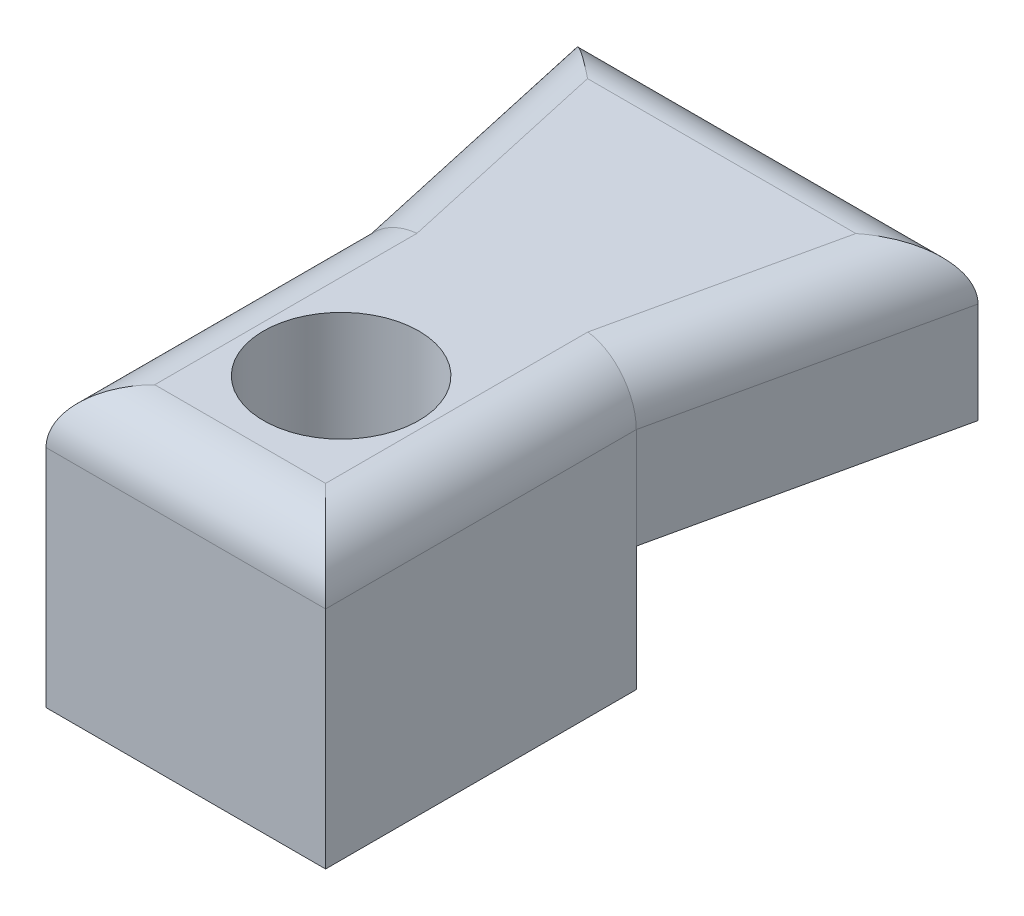
ISO-10303-21;
HEADER;
FILE_DESCRIPTION(('STEP AP214'),'2;1');
FILE_NAME('part.step','',(''),(''),'','','');
FILE_SCHEMA(('AUTOMOTIVE_DESIGN { 1 0 10303 214 1 1 1 1 }'));
ENDSEC;
DATA;
#1=APPLICATION_CONTEXT('core data for automotive mechanical design processes');
#2=APPLICATION_PROTOCOL_DEFINITION('international standard','automotive_design',2000,#1);
#3=PRODUCT_CONTEXT('',#1,'mechanical');
#4=PRODUCT('Part','Part','',(#3));
#5=PRODUCT_RELATED_PRODUCT_CATEGORY('part','',(#4));
#6=PRODUCT_DEFINITION_FORMATION('','',#4);
#7=PRODUCT_DEFINITION_CONTEXT('part definition',#1,'design');
#8=PRODUCT_DEFINITION('design','',#6,#7);
#9=PRODUCT_DEFINITION_SHAPE('','',#8);
#10=(LENGTH_UNIT() NAMED_UNIT(*) SI_UNIT(.MILLI.,.METRE.));
#11=(NAMED_UNIT(*) PLANE_ANGLE_UNIT() SI_UNIT($,.RADIAN.));
#12=(NAMED_UNIT(*) SI_UNIT($,.STERADIAN.) SOLID_ANGLE_UNIT());
#13=UNCERTAINTY_MEASURE_WITH_UNIT(LENGTH_MEASURE(1.E-05),#10,'distance_accuracy_value','');
#14=(GEOMETRIC_REPRESENTATION_CONTEXT(3) GLOBAL_UNCERTAINTY_ASSIGNED_CONTEXT((#13)) GLOBAL_UNIT_ASSIGNED_CONTEXT((#10,
#11,#12)) REPRESENTATION_CONTEXT('',''));
#15=CARTESIAN_POINT('',(0.,0.,0.));
#16=DIRECTION('',(0.,0.,1.));
#17=DIRECTION('',(1.,0.,0.));
#18=AXIS2_PLACEMENT_3D('',#15,#16,#17);
#19=CARTESIAN_POINT('',(0.,0.,10.));
#20=DIRECTION('',(0.,1.,0.));
#21=DIRECTION('',(0.,0.,1.));
#22=AXIS2_PLACEMENT_3D('',#19,#20,#21);
#23=PLANE('',#22);
#24=DIRECTION('',(1.,0.,0.));
#25=VECTOR('',#24,1.);
#26=CARTESIAN_POINT('',(9.,0.,0.));
#27=LINE('',#26,#25);
#28=CARTESIAN_POINT('',(0.,0.,0.));
#29=VERTEX_POINT('',#28);
#30=CARTESIAN_POINT('',(9.,0.,0.));
#31=VERTEX_POINT('',#30);
#32=EDGE_CURVE('E128',#29,#31,#27,.T.);
#33=ORIENTED_EDGE('',*,*,#32,.F.);
#34=DIRECTION('',(0.216930457818656,0.,0.976187060183953));
#35=VECTOR('',#34,1.);
#36=CARTESIAN_POINT('',(0.,0.,0.));
#37=LINE('',#36,#35);
#38=CARTESIAN_POINT('',(-2.,0.,-9.));
#39=VERTEX_POINT('',#38);
#40=EDGE_CURVE('E150',#39,#29,#37,.T.);
#41=ORIENTED_EDGE('',*,*,#40,.F.);
#42=DIRECTION('',(-1.,0.,0.));
#43=VECTOR('',#42,1.);
#44=CARTESIAN_POINT('',(-2.,0.,-9.));
#45=LINE('',#44,#43);
#46=CARTESIAN_POINT('',(11.,0.,-9.));
#47=VERTEX_POINT('',#46);
#48=EDGE_CURVE('E147',#47,#39,#45,.T.);
#49=ORIENTED_EDGE('',*,*,#48,.F.);
#50=DIRECTION('',(0.216930457818656,0.,-0.976187060183953));
#51=VECTOR('',#50,1.);
#52=CARTESIAN_POINT('',(11.,0.,-9.));
#53=LINE('',#52,#51);
#54=EDGE_CURVE('E144',#31,#47,#53,.T.);
#55=ORIENTED_EDGE('',*,*,#54,.F.);
#56=EDGE_LOOP('',(#33,#41,#49,#55));
#57=FACE_BOUND('',#56,.T.);
#58=ADVANCED_FACE('F33',(#57),#23,.F.);
#59=CARTESIAN_POINT('',(0.,5.,0.));
#60=DIRECTION('',(1.,0.,0.));
#61=DIRECTION('',(0.,0.,-1.));
#62=AXIS2_PLACEMENT_3D('',#59,#60,#61);
#63=PLANE('',#62);
#64=DIRECTION('',(0.,-1.,0.));
#65=VECTOR('',#64,1.);
#66=CARTESIAN_POINT('',(0.,5.,10.));
#67=LINE('',#66,#65);
#68=CARTESIAN_POINT('',(0.,3.25,10.));
#69=VERTEX_POINT('',#68);
#70=CARTESIAN_POINT('',(0.,-4.,10.));
#71=VERTEX_POINT('',#70);
#72=EDGE_CURVE('E114',#69,#71,#67,.T.);
#73=ORIENTED_EDGE('',*,*,#72,.F.);
#74=DIRECTION('',(0.,0.,1.));
#75=VECTOR('',#74,1.);
#76=CARTESIAN_POINT('',(0.,3.25,0.));
#77=LINE('',#76,#75);
#78=CARTESIAN_POINT('',(0.,3.25,0.));
#79=VERTEX_POINT('',#78);
#80=EDGE_CURVE('E181',#69,#79,#77,.F.);
#81=ORIENTED_EDGE('',*,*,#80,.T.);
#82=DIRECTION('',(0.,-1.,0.));
#83=VECTOR('',#82,1.);
#84=CARTESIAN_POINT('',(0.,5.,0.));
#85=LINE('',#84,#83);
#86=EDGE_CURVE('E153',#79,#29,#85,.T.);
#87=ORIENTED_EDGE('',*,*,#86,.T.);
#88=DIRECTION('',(0.,1.,0.));
#89=VECTOR('',#88,1.);
#90=CARTESIAN_POINT('',(0.,-4.,0.));
#91=LINE('',#90,#89);
#92=CARTESIAN_POINT('',(0.,-4.,0.));
#93=VERTEX_POINT('',#92);
#94=EDGE_CURVE('E141',#93,#29,#91,.T.);
#95=ORIENTED_EDGE('',*,*,#94,.F.);
#96=DIRECTION('',(0.,0.,-1.));
#97=VECTOR('',#96,1.);
#98=CARTESIAN_POINT('',(0.,-4.,0.));
#99=LINE('',#98,#97);
#100=EDGE_CURVE('E122',#71,#93,#99,.T.);
#101=ORIENTED_EDGE('',*,*,#100,.F.);
#102=EDGE_LOOP('',(#73,#81,#87,#95,#101));
#103=FACE_BOUND('',#102,.T.);
#104=ADVANCED_FACE('F224',(#103),#63,.F.);
#105=CARTESIAN_POINT('',(0.,5.,10.));
#106=DIRECTION('',(0.,0.,-1.));
#107=DIRECTION('',(-1.,0.,0.));
#108=AXIS2_PLACEMENT_3D('',#105,#106,#107);
#109=PLANE('',#108);
#110=DIRECTION('',(0.,-1.,0.));
#111=VECTOR('',#110,1.);
#112=CARTESIAN_POINT('',(9.,5.,10.));
#113=LINE('',#112,#111);
#114=CARTESIAN_POINT('',(9.,3.25,10.));
#115=VERTEX_POINT('',#114);
#116=CARTESIAN_POINT('',(9.,-4.,10.));
#117=VERTEX_POINT('',#116);
#118=EDGE_CURVE('E108',#115,#117,#113,.T.);
#119=ORIENTED_EDGE('',*,*,#118,.F.);
#120=DIRECTION('',(1.,0.,0.));
#121=VECTOR('',#120,1.);
#122=CARTESIAN_POINT('',(0.,3.25,10.));
#123=LINE('',#122,#121);
#124=EDGE_CURVE('E11',#115,#69,#123,.F.);
#125=ORIENTED_EDGE('',*,*,#124,.T.);
#126=ORIENTED_EDGE('',*,*,#72,.T.);
#127=DIRECTION('',(-1.,0.,0.));
#128=VECTOR('',#127,1.);
#129=CARTESIAN_POINT('',(9.,-4.,10.));
#130=LINE('',#129,#128);
#131=EDGE_CURVE('E118',#117,#71,#130,.T.);
#132=ORIENTED_EDGE('',*,*,#131,.F.);
#133=EDGE_LOOP('',(#119,#125,#126,#132));
#134=FACE_BOUND('',#133,.T.);
#135=ADVANCED_FACE('F119',(#134),#109,.F.);
#136=CARTESIAN_POINT('',(9.,5.,0.));
#137=DIRECTION('',(-1.,0.,0.));
#138=DIRECTION('',(0.,0.,1.));
#139=AXIS2_PLACEMENT_3D('',#136,#137,#138);
#140=PLANE('',#139);
#141=DIRECTION('',(0.,-1.,0.));
#142=VECTOR('',#141,1.);
#143=CARTESIAN_POINT('',(9.,5.,0.));
#144=LINE('',#143,#142);
#145=CARTESIAN_POINT('',(9.,3.25,0.));
#146=VERTEX_POINT('',#145);
#147=EDGE_CURVE('E115',#146,#31,#144,.T.);
#148=ORIENTED_EDGE('',*,*,#147,.F.);
#149=DIRECTION('',(0.,0.,-1.));
#150=VECTOR('',#149,1.);
#151=CARTESIAN_POINT('',(9.,3.25,10.));
#152=LINE('',#151,#150);
#153=EDGE_CURVE('E42',#146,#115,#152,.F.);
#154=ORIENTED_EDGE('',*,*,#153,.T.);
#155=ORIENTED_EDGE('',*,*,#118,.T.);
#156=DIRECTION('',(0.,0.,1.));
#157=VECTOR('',#156,1.);
#158=CARTESIAN_POINT('',(9.,-4.,0.));
#159=LINE('',#158,#157);
#160=CARTESIAN_POINT('',(9.,-4.,0.));
#161=VERTEX_POINT('',#160);
#162=EDGE_CURVE('E113',#161,#117,#159,.T.);
#163=ORIENTED_EDGE('',*,*,#162,.F.);
#164=DIRECTION('',(0.,1.,0.));
#165=VECTOR('',#164,1.);
#166=CARTESIAN_POINT('',(9.,-4.,0.));
#167=LINE('',#166,#165);
#168=EDGE_CURVE('E138',#161,#31,#167,.T.);
#169=ORIENTED_EDGE('',*,*,#168,.T.);
#170=EDGE_LOOP('',(#148,#154,#155,#163,#169));
#171=FACE_BOUND('',#170,.T.);
#172=ADVANCED_FACE('F110',(#171),#140,.F.);
#173=CARTESIAN_POINT('',(11.,5.,-9.));
#174=DIRECTION('',(-0.976187060183953,0.,-0.216930457818656));
#175=DIRECTION('',(-0.216930457818656,0.,0.976187060183953));
#176=AXIS2_PLACEMENT_3D('',#173,#174,#175);
#177=PLANE('',#176);
#178=DIRECTION('',(0.,-1.,0.));
#179=VECTOR('',#178,1.);
#180=CARTESIAN_POINT('',(11.,5.,-9.));
#181=LINE('',#180,#179);
#182=CARTESIAN_POINT('',(11.,3.25,-9.));
#183=VERTEX_POINT('',#182);
#184=EDGE_CURVE('E157',#183,#47,#181,.T.);
#185=ORIENTED_EDGE('',*,*,#184,.F.);
#186=DIRECTION('',(0.216930457818656,0.,-0.976187060183953));
#187=VECTOR('',#186,1.);
#188=CARTESIAN_POINT('',(9.,3.25,0.));
#189=LINE('',#188,#187);
#190=EDGE_CURVE('E177',#183,#146,#189,.F.);
#191=ORIENTED_EDGE('',*,*,#190,.T.);
#192=ORIENTED_EDGE('',*,*,#147,.T.);
#193=ORIENTED_EDGE('',*,*,#54,.T.);
#194=EDGE_LOOP('',(#185,#191,#192,#193));
#195=FACE_BOUND('',#194,.T.);
#196=ADVANCED_FACE('F244',(#195),#177,.F.);
#197=CARTESIAN_POINT('',(-2.,5.,-9.));
#198=DIRECTION('',(0.,0.,1.));
#199=DIRECTION('',(1.,0.,0.));
#200=AXIS2_PLACEMENT_3D('',#197,#198,#199);
#201=PLANE('',#200);
#202=DIRECTION('',(0.,-1.,0.));
#203=VECTOR('',#202,1.);
#204=CARTESIAN_POINT('',(-2.,5.,-9.));
#205=LINE('',#204,#203);
#206=CARTESIAN_POINT('',(-2.,3.25,-9.));
#207=VERTEX_POINT('',#206);
#208=EDGE_CURVE('E155',#207,#39,#205,.T.);
#209=ORIENTED_EDGE('',*,*,#208,.F.);
#210=DIRECTION('',(-1.,0.,0.));
#211=VECTOR('',#210,1.);
#212=CARTESIAN_POINT('',(11.,3.25,-9.));
#213=LINE('',#212,#211);
#214=EDGE_CURVE('E174',#207,#183,#213,.F.);
#215=ORIENTED_EDGE('',*,*,#214,.T.);
#216=ORIENTED_EDGE('',*,*,#184,.T.);
#217=ORIENTED_EDGE('',*,*,#48,.T.);
#218=EDGE_LOOP('',(#209,#215,#216,#217));
#219=FACE_BOUND('',#218,.T.);
#220=ADVANCED_FACE('F240',(#219),#201,.F.);
#221=CARTESIAN_POINT('',(0.,5.,0.));
#222=DIRECTION('',(0.976187060183953,0.,-0.216930457818656));
#223=DIRECTION('',(-0.216930457818656,0.,-0.976187060183953));
#224=AXIS2_PLACEMENT_3D('',#221,#222,#223);
#225=PLANE('',#224);
#226=ORIENTED_EDGE('',*,*,#86,.F.);
#227=DIRECTION('',(0.216930457818656,0.,0.976187060183953));
#228=VECTOR('',#227,1.);
#229=CARTESIAN_POINT('',(-2.,3.25,-9.00000000000001));
#230=LINE('',#229,#228);
#231=EDGE_CURVE('E179',#79,#207,#230,.F.);
#232=ORIENTED_EDGE('',*,*,#231,.T.);
#233=ORIENTED_EDGE('',*,*,#208,.T.);
#234=ORIENTED_EDGE('',*,*,#40,.T.);
#235=EDGE_LOOP('',(#226,#232,#233,#234));
#236=FACE_BOUND('',#235,.T.);
#237=ADVANCED_FACE('F237',(#236),#225,.F.);
#238=CARTESIAN_POINT('',(0.,5.,10.));
#239=DIRECTION('',(0.,1.,0.));
#240=DIRECTION('',(0.,0.,1.));
#241=AXIS2_PLACEMENT_3D('',#238,#239,#240);
#242=PLANE('',#241);
#243=DIRECTION('',(0.216930457818656,0.,-0.976187060183953));
#244=VECTOR('',#243,1.);
#245=CARTESIAN_POINT('',(9.29167264467808,5.,-9.37962830118265));
#246=LINE('',#245,#244);
#247=CARTESIAN_POINT('',(7.25,5.,-0.192101400131284));
#248=VERTEX_POINT('',#247);
#249=CARTESIAN_POINT('',(8.81842191108194,5.,-7.25));
#250=VERTEX_POINT('',#249);
#251=EDGE_CURVE('E169',#248,#250,#246,.T.);
#252=ORIENTED_EDGE('',*,*,#251,.T.);
#253=DIRECTION('',(-1.,0.,0.));
#254=VECTOR('',#253,1.);
#255=CARTESIAN_POINT('',(-2.,5.,-7.25));
#256=LINE('',#255,#254);
#257=CARTESIAN_POINT('',(0.18157808891806,5.,-7.25));
#258=VERTEX_POINT('',#257);
#259=EDGE_CURVE('E171',#250,#258,#256,.T.);
#260=ORIENTED_EDGE('',*,*,#259,.T.);
#261=DIRECTION('',(0.216930457818656,0.,0.976187060183953));
#262=VECTOR('',#261,1.);
#263=CARTESIAN_POINT('',(1.70832735532192,5.,-0.37962830118265));
#264=LINE('',#263,#262);
#265=CARTESIAN_POINT('',(1.75,5.,-0.192101400131275));
#266=VERTEX_POINT('',#265);
#267=EDGE_CURVE('E167',#258,#266,#264,.T.);
#268=ORIENTED_EDGE('',*,*,#267,.T.);
#269=DIRECTION('',(0.,0.,1.));
#270=VECTOR('',#269,1.);
#271=CARTESIAN_POINT('',(1.75,5.,10.));
#272=LINE('',#271,#270);
#273=CARTESIAN_POINT('',(1.75,5.,8.25));
#274=VERTEX_POINT('',#273);
#275=EDGE_CURVE('E165',#266,#274,#272,.T.);
#276=ORIENTED_EDGE('',*,*,#275,.T.);
#277=DIRECTION('',(1.,0.,0.));
#278=VECTOR('',#277,1.);
#279=CARTESIAN_POINT('',(9.,5.,8.25));
#280=LINE('',#279,#278);
#281=CARTESIAN_POINT('',(7.25,5.,8.25));
#282=VERTEX_POINT('',#281);
#283=EDGE_CURVE('E161',#274,#282,#280,.T.);
#284=ORIENTED_EDGE('',*,*,#283,.T.);
#285=DIRECTION('',(0.,0.,-1.));
#286=VECTOR('',#285,1.);
#287=CARTESIAN_POINT('',(7.25,5.,0.));
#288=LINE('',#287,#286);
#289=EDGE_CURVE('E163',#282,#248,#288,.T.);
#290=ORIENTED_EDGE('',*,*,#289,.T.);
#291=EDGE_LOOP('',(#252,#260,#268,#276,#284,#290));
#292=FACE_BOUND('',#291,.T.);
#293=CARTESIAN_POINT('',(4.5,5.,5.));
#294=DIRECTION('',(0.,-1.,0.));
#295=DIRECTION('',(0.,0.,-1.));
#296=AXIS2_PLACEMENT_3D('',#293,#294,#295);
#297=CIRCLE('',#296,2.5);
#298=CARTESIAN_POINT('',(4.5,5.,2.5));
#299=VERTEX_POINT('',#298);
#300=EDGE_CURVE('E131',#299,#299,#297,.T.);
#301=ORIENTED_EDGE('',*,*,#300,.T.);
#302=EDGE_LOOP('',(#301));
#303=FACE_BOUND('',#302,.T.);
#304=ADVANCED_FACE('F209',(#292,#303),#242,.T.);
#305=CARTESIAN_POINT('',(9.,-4.,0.));
#306=DIRECTION('',(0.,0.,1.));
#307=DIRECTION('',(1.,0.,0.));
#308=AXIS2_PLACEMENT_3D('',#305,#306,#307);
#309=PLANE('',#308);
#310=ORIENTED_EDGE('',*,*,#32,.T.);
#311=ORIENTED_EDGE('',*,*,#168,.F.);
#312=DIRECTION('',(1.,0.,0.));
#313=VECTOR('',#312,1.);
#314=CARTESIAN_POINT('',(9.,-4.,0.));
#315=LINE('',#314,#313);
#316=EDGE_CURVE('E126',#93,#161,#315,.T.);
#317=ORIENTED_EDGE('',*,*,#316,.F.);
#318=ORIENTED_EDGE('',*,*,#94,.T.);
#319=EDGE_LOOP('',(#310,#311,#317,#318));
#320=FACE_BOUND('',#319,.T.);
#321=ADVANCED_FACE('F220',(#320),#309,.F.);
#322=CARTESIAN_POINT('',(9.,-4.,10.));
#323=DIRECTION('',(0.,-1.,0.));
#324=DIRECTION('',(0.,0.,-1.));
#325=AXIS2_PLACEMENT_3D('',#322,#323,#324);
#326=PLANE('',#325);
#327=CARTESIAN_POINT('',(4.5,-4.,5.));
#328=DIRECTION('',(0.,-1.,0.));
#329=DIRECTION('',(0.,0.,-1.));
#330=AXIS2_PLACEMENT_3D('',#327,#328,#329);
#331=CIRCLE('',#330,2.5);
#332=CARTESIAN_POINT('',(4.5,-4.,2.5));
#333=VERTEX_POINT('',#332);
#334=EDGE_CURVE('E134',#333,#333,#331,.T.);
#335=ORIENTED_EDGE('',*,*,#334,.F.);
#336=EDGE_LOOP('',(#335));
#337=FACE_BOUND('',#336,.T.);
#338=ORIENTED_EDGE('',*,*,#162,.T.);
#339=ORIENTED_EDGE('',*,*,#131,.T.);
#340=ORIENTED_EDGE('',*,*,#100,.T.);
#341=ORIENTED_EDGE('',*,*,#316,.T.);
#342=EDGE_LOOP('',(#338,#339,#340,#341));
#343=FACE_BOUND('',#342,.T.);
#344=ADVANCED_FACE('F124',(#337,#343),#326,.T.);
#345=CARTESIAN_POINT('',(4.5,5.,5.));
#346=DIRECTION('',(0.,-1.,0.));
#347=DIRECTION('',(0.,0.,-1.));
#348=AXIS2_PLACEMENT_3D('',#345,#346,#347);
#349=CYLINDRICAL_SURFACE('',#348,2.5);
#350=ORIENTED_EDGE('',*,*,#300,.F.);
#351=EDGE_LOOP('',(#350));
#352=FACE_BOUND('',#351,.T.);
#353=ORIENTED_EDGE('',*,*,#334,.T.);
#354=EDGE_LOOP('',(#353));
#355=FACE_BOUND('',#354,.T.);
#356=ADVANCED_FACE('F211',(#352,#355),#349,.F.);
#357=CARTESIAN_POINT('',(0.,3.25,8.25));
#358=DIRECTION('',(-1.,0.,0.));
#359=DIRECTION('',(0.,0.,1.));
#360=AXIS2_PLACEMENT_3D('',#357,#358,#359);
#361=CYLINDRICAL_SURFACE('',#360,1.75);
#362=CARTESIAN_POINT('',(1.75,3.25,8.25));
#363=DIRECTION('',(-0.707106781186548,0.,-0.707106781186547));
#364=DIRECTION('',(-0.707106781186547,0.,0.707106781186548));
#365=AXIS2_PLACEMENT_3D('',#362,#363,#364);
#366=ELLIPSE('',#365,2.47487373415292,1.75);
#367=EDGE_CURVE('E193',#69,#274,#366,.T.);
#368=ORIENTED_EDGE('',*,*,#367,.F.);
#369=ORIENTED_EDGE('',*,*,#124,.F.);
#370=CARTESIAN_POINT('',(7.25,3.25,8.25));
#371=DIRECTION('',(-0.707106781186547,0.,0.707106781186548));
#372=DIRECTION('',(-0.707106781186548,0.,-0.707106781186547));
#373=AXIS2_PLACEMENT_3D('',#370,#371,#372);
#374=ELLIPSE('',#373,2.47487373415292,1.75);
#375=EDGE_CURVE('E37',#282,#115,#374,.F.);
#376=ORIENTED_EDGE('',*,*,#375,.F.);
#377=ORIENTED_EDGE('',*,*,#283,.F.);
#378=EDGE_LOOP('',(#368,#369,#376,#377));
#379=FACE_BOUND('',#378,.T.);
#380=ADVANCED_FACE('F35',(#379),#361,.T.);
#381=CARTESIAN_POINT('',(7.25,3.25,10.));
#382=DIRECTION('',(0.,0.,1.));
#383=DIRECTION('',(1.,0.,0.));
#384=AXIS2_PLACEMENT_3D('',#381,#382,#383);
#385=CYLINDRICAL_SURFACE('',#384,1.75);
#386=ORIENTED_EDGE('',*,*,#375,.T.);
#387=ORIENTED_EDGE('',*,*,#153,.F.);
#388=CARTESIAN_POINT('',(7.25,3.25,-0.192101400131275));
#389=DIRECTION('',(-0.109116771891509,0.,0.994028938256818));
#390=DIRECTION('',(-0.994028938256818,0.,-0.109116771891509));
#391=AXIS2_PLACEMENT_3D('',#388,#389,#390);
#392=ELLIPSE('',#391,1.76051212660759,1.75);
#393=EDGE_CURVE('E191',#248,#146,#392,.F.);
#394=ORIENTED_EDGE('',*,*,#393,.F.);
#395=ORIENTED_EDGE('',*,*,#289,.F.);
#396=EDGE_LOOP('',(#386,#387,#394,#395));
#397=FACE_BOUND('',#396,.T.);
#398=ADVANCED_FACE('F218',(#397),#385,.T.);
#399=CARTESIAN_POINT('',(1.75,3.25,10.));
#400=DIRECTION('',(0.,0.,-1.));
#401=DIRECTION('',(-1.,0.,0.));
#402=AXIS2_PLACEMENT_3D('',#399,#400,#401);
#403=CYLINDRICAL_SURFACE('',#402,1.75);
#404=ORIENTED_EDGE('',*,*,#367,.T.);
#405=ORIENTED_EDGE('',*,*,#275,.F.);
#406=CARTESIAN_POINT('',(1.75,3.25,-0.192101400131275));
#407=DIRECTION('',(-0.109116771891509,0.,-0.994028938256818));
#408=DIRECTION('',(-0.994028938256818,0.,0.109116771891509));
#409=AXIS2_PLACEMENT_3D('',#406,#407,#408);
#410=ELLIPSE('',#409,1.76051212660759,1.75);
#411=EDGE_CURVE('E188',#79,#266,#410,.T.);
#412=ORIENTED_EDGE('',*,*,#411,.F.);
#413=ORIENTED_EDGE('',*,*,#80,.F.);
#414=EDGE_LOOP('',(#404,#405,#412,#413));
#415=FACE_BOUND('',#414,.T.);
#416=ADVANCED_FACE('F264',(#415),#403,.T.);
#417=CARTESIAN_POINT('',(4.75049617408985,3.25,11.0556658164644));
#418=DIRECTION('',(-0.216930457818656,0.,0.976187060183953));
#419=DIRECTION('',(0.976187060183953,0.,0.216930457818656));
#420=AXIS2_PLACEMENT_3D('',#417,#418,#419);
#421=CYLINDRICAL_SURFACE('',#420,1.75);
#422=ORIENTED_EDGE('',*,*,#393,.T.);
#423=ORIENTED_EDGE('',*,*,#190,.F.);
#424=CARTESIAN_POINT('',(8.81842191108194,3.25,-7.25));
#425=DIRECTION('',(0.625727393591388,0.,0.780041812282731));
#426=DIRECTION('',(-0.780041812282731,0.,0.625727393591388));
#427=AXIS2_PLACEMENT_3D('',#424,#425,#426);
#428=ELLIPSE('',#427,2.79674506490087,1.75);
#429=EDGE_CURVE('E186',#250,#183,#428,.F.);
#430=ORIENTED_EDGE('',*,*,#429,.F.);
#431=ORIENTED_EDGE('',*,*,#251,.F.);
#432=EDGE_LOOP('',(#422,#423,#430,#431));
#433=FACE_BOUND('',#432,.T.);
#434=ADVANCED_FACE('F260',(#433),#421,.T.);
#435=CARTESIAN_POINT('',(3.82597441414545,3.25,9.14978346352323));
#436=DIRECTION('',(-0.216930457818656,0.,-0.976187060183953));
#437=DIRECTION('',(-0.976187060183953,0.,0.216930457818656));
#438=AXIS2_PLACEMENT_3D('',#435,#436,#437);
#439=CYLINDRICAL_SURFACE('',#438,1.75);
#440=ORIENTED_EDGE('',*,*,#411,.T.);
#441=ORIENTED_EDGE('',*,*,#267,.F.);
#442=CARTESIAN_POINT('',(0.18157808891806,3.25,-7.25));
#443=DIRECTION('',(0.625727393591388,0.,-0.780041812282732));
#444=DIRECTION('',(-0.780041812282732,0.,-0.625727393591388));
#445=AXIS2_PLACEMENT_3D('',#442,#443,#444);
#446=ELLIPSE('',#445,2.79674506490087,1.75);
#447=EDGE_CURVE('E184',#207,#258,#446,.T.);
#448=ORIENTED_EDGE('',*,*,#447,.F.);
#449=ORIENTED_EDGE('',*,*,#231,.F.);
#450=EDGE_LOOP('',(#440,#441,#448,#449));
#451=FACE_BOUND('',#450,.T.);
#452=ADVANCED_FACE('F256',(#451),#439,.T.);
#453=CARTESIAN_POINT('',(0.,3.25,-7.25));
#454=DIRECTION('',(1.,0.,0.));
#455=DIRECTION('',(0.,0.,-1.));
#456=AXIS2_PLACEMENT_3D('',#453,#454,#455);
#457=CYLINDRICAL_SURFACE('',#456,1.75);
#458=ORIENTED_EDGE('',*,*,#429,.T.);
#459=ORIENTED_EDGE('',*,*,#214,.F.);
#460=ORIENTED_EDGE('',*,*,#447,.T.);
#461=ORIENTED_EDGE('',*,*,#259,.F.);
#462=EDGE_LOOP('',(#458,#459,#460,#461));
#463=FACE_BOUND('',#462,.T.);
#464=ADVANCED_FACE('F253',(#463),#457,.T.);
#465=CLOSED_SHELL('',(#58,#104,#135,#172,#196,#220,#237,#304,#321,#344,#356,#380,#398,#416,#434,
#452,#464));
#466=MANIFOLD_SOLID_BREP('B2',#465);
#467=ADVANCED_BREP_SHAPE_REPRESENTATION('',(#18,#466),#14);
#468=SHAPE_DEFINITION_REPRESENTATION(#9,#467);
ENDSEC;
END-ISO-10303-21;
